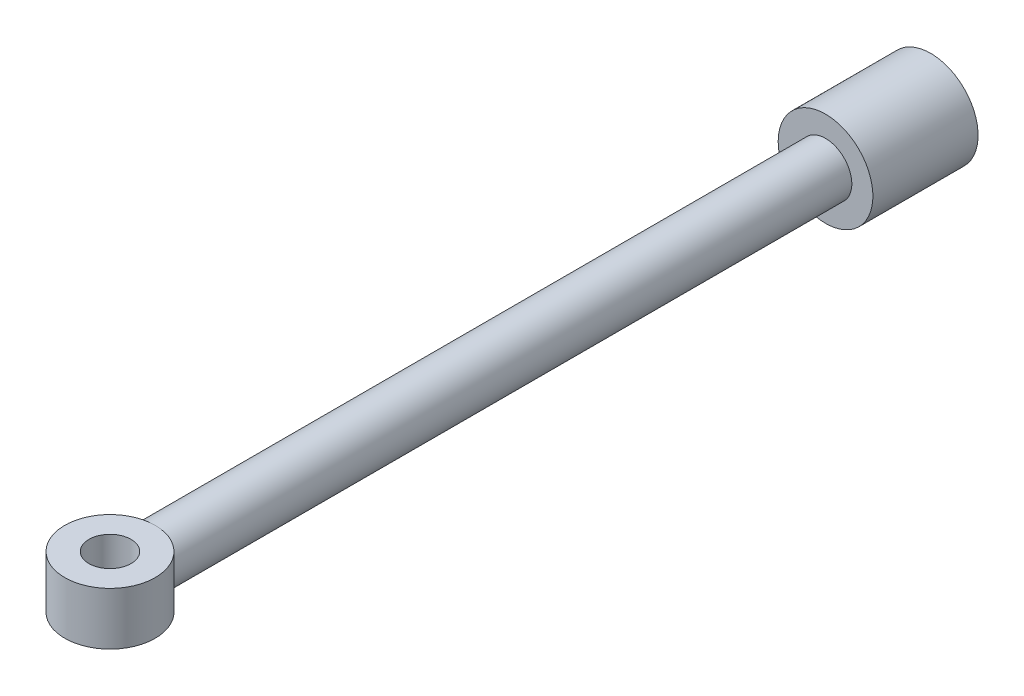
ISO-10303-21;
HEADER;
FILE_DESCRIPTION(('STEP AP214'),'2;1');
FILE_NAME('part.step','',(''),(''),'','','');
FILE_SCHEMA(('AUTOMOTIVE_DESIGN { 1 0 10303 214 1 1 1 1 }'));
ENDSEC;
DATA;
#1=APPLICATION_CONTEXT('core data for automotive mechanical design processes');
#2=APPLICATION_PROTOCOL_DEFINITION('international standard','automotive_design',2000,#1);
#3=PRODUCT_CONTEXT('',#1,'mechanical');
#4=PRODUCT('Part','Part','',(#3));
#5=PRODUCT_RELATED_PRODUCT_CATEGORY('part','',(#4));
#6=PRODUCT_DEFINITION_FORMATION('','',#4);
#7=PRODUCT_DEFINITION_CONTEXT('part definition',#1,'design');
#8=PRODUCT_DEFINITION('design','',#6,#7);
#9=PRODUCT_DEFINITION_SHAPE('','',#8);
#10=(LENGTH_UNIT() NAMED_UNIT(*) SI_UNIT(.MILLI.,.METRE.));
#11=(NAMED_UNIT(*) PLANE_ANGLE_UNIT() SI_UNIT($,.RADIAN.));
#12=(NAMED_UNIT(*) SI_UNIT($,.STERADIAN.) SOLID_ANGLE_UNIT());
#13=UNCERTAINTY_MEASURE_WITH_UNIT(LENGTH_MEASURE(1.E-05),#10,'distance_accuracy_value','');
#14=(GEOMETRIC_REPRESENTATION_CONTEXT(3) GLOBAL_UNCERTAINTY_ASSIGNED_CONTEXT((#13)) GLOBAL_UNIT_ASSIGNED_CONTEXT((#10,
#11,#12)) REPRESENTATION_CONTEXT('',''));
#15=CARTESIAN_POINT('',(0.,0.,0.));
#16=DIRECTION('',(0.,0.,1.));
#17=DIRECTION('',(1.,0.,0.));
#18=AXIS2_PLACEMENT_3D('',#15,#16,#17);
#19=CARTESIAN_POINT('',(0.,0.,75.));
#20=DIRECTION('',(0.,0.,-1.));
#21=DIRECTION('',(-1.,0.,0.));
#22=AXIS2_PLACEMENT_3D('',#19,#20,#21);
#23=CYLINDRICAL_SURFACE('',#22,25.);
#24=CARTESIAN_POINT('',(0.,0.,175.));
#25=DIRECTION('',(0.,0.,-1.));
#26=DIRECTION('',(-1.,0.,0.));
#27=AXIS2_PLACEMENT_3D('',#24,#25,#26);
#28=CIRCLE('',#27,25.);
#29=CARTESIAN_POINT('',(-25.,0.,175.));
#30=VERTEX_POINT('',#29);
#31=EDGE_CURVE('E65',#30,#30,#28,.T.);
#32=ORIENTED_EDGE('',*,*,#31,.F.);
#33=EDGE_LOOP('',(#32));
#34=FACE_BOUND('',#33,.T.);
#35=CARTESIAN_POINT('',(0.,25.,812.));
#36=CARTESIAN_POINT('',(-0.323073219483373,25.0000073405273,811.999991917627));
#37=CARTESIAN_POINT('',(-0.646141502338046,24.9937375418738,812.003640863775));
#38=CARTESIAN_POINT('',(-1.29162001946689,24.9686991510117,812.018192836309));
#39=CARTESIAN_POINT('',(-1.61403027385897,24.9499309468376,812.029095637485));
#40=CARTESIAN_POINT('',(-2.25741128983295,24.8999631376806,812.058088437141));
#41=CARTESIAN_POINT('',(-2.57838266443131,24.8687694638436,812.076175006525));
#42=CARTESIAN_POINT('',(-3.21838786165717,24.7940682668799,812.119411054166));
#43=CARTESIAN_POINT('',(-3.5374216777822,24.7505607024509,812.144560556112));
#44=CARTESIAN_POINT('',(-4.48730779691503,24.6022973988042,812.230076116417));
#45=CARTESIAN_POINT('',(-5.1145512854202,24.4795184962338,812.300674658644));
#46=CARTESIAN_POINT('',(-6.35450877170136,24.1873147832337,812.467519884291));
#47=CARTESIAN_POINT('',(-6.96722161414905,24.0178862771203,812.563768599754));
#48=CARTESIAN_POINT('',(-8.17325775073618,23.6346675452906,812.77947806231));
#49=CARTESIAN_POINT('',(-8.76661117389672,23.4209504719296,812.898900512425));
#50=CARTESIAN_POINT('',(-9.93159556183184,22.9512078223228,813.15839840602));
#51=CARTESIAN_POINT('',(-10.5032266492576,22.6951824850065,813.298473732864));
#52=CARTESIAN_POINT('',(-11.6225774564603,22.1428459411344,813.596479530529));
#53=CARTESIAN_POINT('',(-12.1702716259285,21.8464930125044,813.75442846412));
#54=CARTESIAN_POINT('',(-13.2388292536092,21.2159917334919,814.084889987469));
#55=CARTESIAN_POINT('',(-13.759691534578,20.8818417268222,814.257403215356));
#56=CARTESIAN_POINT('',(-14.8097037618993,20.152189070235,814.626684737254));
#57=CARTESIAN_POINT('',(-15.3366791442554,19.7539876429895,814.824304274079));
#58=CARTESIAN_POINT('',(-16.355570131578,18.9190176170641,815.228204609291));
#59=CARTESIAN_POINT('',(-16.8474842861503,18.4822474245634,815.434485765429));
#60=CARTESIAN_POINT('',(-17.7949550173283,17.5718979612226,815.851465937347));
#61=CARTESIAN_POINT('',(-18.2504761742981,17.0982836954337,816.062169010958));
#62=CARTESIAN_POINT('',(-19.1229526377762,16.1165747091056,816.483155088647));
#63=CARTESIAN_POINT('',(-19.5399059530893,15.6084782106497,816.69343807049));
#64=CARTESIAN_POINT('',(-20.3786164952388,14.4999450687305,817.132326474249));
#65=CARTESIAN_POINT('',(-20.7955295482988,13.8955778996803,817.36029664006));
#66=CARTESIAN_POINT('',(-21.576620180258,12.6487421591043,817.802540616851));
#67=CARTESIAN_POINT('',(-21.9407898478575,12.0062678919936,818.016812370435));
#68=CARTESIAN_POINT('',(-22.6127328991702,10.6869824653493,818.42379930329));
#69=CARTESIAN_POINT('',(-22.9205777197122,10.0102162099253,818.616541665673));
#70=CARTESIAN_POINT('',(-23.4767842757009,8.62536266913667,818.972928714695));
#71=CARTESIAN_POINT('',(-23.7251664515645,7.91728624615677,819.136583395293));
#72=CARTESIAN_POINT('',(-24.1092135452026,6.63955323298844,819.394012848847));
#73=CARTESIAN_POINT('',(-24.2576658880458,6.07520751593119,819.495211205358));
#74=CARTESIAN_POINT('',(-24.5153025535408,4.93376834216407,819.672610024112));
#75=CARTESIAN_POINT('',(-24.624492741889,4.3566768033426,819.74881422029));
#76=CARTESIAN_POINT('',(-24.8021169016052,3.19383705209388,819.873559654141));
#77=CARTESIAN_POINT('',(-24.8705893792807,2.60809755702325,819.922127025787));
#78=CARTESIAN_POINT('',(-24.9659584223035,1.43151915987221,819.989938896084));
#79=CARTESIAN_POINT('',(-24.9928541916901,0.840680160382653,820.009182833357));
#80=CARTESIAN_POINT('',(-25.0046644537354,-0.342553531027865,820.017621374834));
#81=CARTESIAN_POINT('',(-24.9895136493183,-0.934949213713527,820.006769240754));
#82=CARTESIAN_POINT('',(-24.9173247406087,-2.11586738550418,819.95533043359));
#83=CARTESIAN_POINT('',(-24.8602864559335,-2.7043898579187,819.914743632457));
#84=CARTESIAN_POINT('',(-24.705118667433,-3.87365051320268,819.805311753865));
#85=CARTESIAN_POINT('',(-24.6069650173244,-4.45438391452943,819.736450071568));
#86=CARTESIAN_POINT('',(-24.3708826196281,-5.6039678815932,819.572882645657));
#87=CARTESIAN_POINT('',(-24.2329529294204,-6.17281816537927,819.478176289573));
#88=CARTESIAN_POINT('',(-23.9200588841416,-7.29148537237563,819.266736481832));
#89=CARTESIAN_POINT('',(-23.7453650735208,-7.84140893784098,819.150164583484));
#90=CARTESIAN_POINT('',(-23.3599923313202,-8.92418988387642,818.897870163549));
#91=CARTESIAN_POINT('',(-23.149298868061,-9.4570402691045,818.762139912332));
#92=CARTESIAN_POINT('',(-22.6936550015159,-10.5035103373492,818.47507028058));
#93=CARTESIAN_POINT('',(-22.4487039520211,-11.017129657374,818.323730605615));
#94=CARTESIAN_POINT('',(-21.9261058615668,-12.0236223707595,818.008934340018));
#95=CARTESIAN_POINT('',(-21.6484550342576,-12.5164933526563,817.845476347004));
#96=CARTESIAN_POINT('',(-21.0133747545135,-13.5598748043819,817.482096451958));
#97=CARTESIAN_POINT('',(-20.6503450688302,-14.1064404244398,817.280614309169));
#98=CARTESIAN_POINT('',(-19.8838315939996,-15.1677892371372,816.870980814586));
#99=CARTESIAN_POINT('',(-19.4803443889607,-15.6825697401703,816.662828900663));
#100=CARTESIAN_POINT('',(-18.6343106730208,-16.6790289504848,816.244544541118));
#101=CARTESIAN_POINT('',(-18.1917279308608,-17.1606762010386,816.034410423032));
#102=CARTESIAN_POINT('',(-17.2695024774643,-18.0884534042604,815.617002238479));
#103=CARTESIAN_POINT('',(-16.7898579259701,-18.5345815910375,815.409728314636));
#104=CARTESIAN_POINT('',(-15.733857262801,-19.4419172482329,814.977381346595));
#105=CARTESIAN_POINT('',(-15.1528672405291,-19.8982075430565,814.753262732965));
#106=CARTESIAN_POINT('',(-13.9488810741164,-20.7599803780785,814.320300022891));
#107=CARTESIAN_POINT('',(-13.3258810956641,-21.1654582708725,814.111457324338));
#108=CARTESIAN_POINT('',(-12.0423003328998,-21.9211449030045,813.715217486015));
#109=CARTESIAN_POINT('',(-11.3817895732271,-22.2714523003018,813.527782233517));
#110=CARTESIAN_POINT('',(-10.0262438133686,-22.9136791762596,813.179384301884));
#111=CARTESIAN_POINT('',(-9.33121177846104,-23.2056036590542,813.018419354127));
#112=CARTESIAN_POINT('',(-7.94372462011019,-23.7153694620421,812.734458317691));
#113=CARTESIAN_POINT('',(-7.2525598476481,-23.935952478089,812.610080026114));
#114=CARTESIAN_POINT('',(-5.84882965497463,-24.3170639383683,812.393722450943));
#115=CARTESIAN_POINT('',(-5.13626793238095,-24.4776026950914,812.301737603995));
#116=CARTESIAN_POINT('',(-4.05369539716519,-24.671920503785,812.189943321606));
#117=CARTESIAN_POINT('',(-3.68905733973753,-24.7290793691959,812.156963391952));
#118=CARTESIAN_POINT('',(-2.95687043208221,-24.8272688018788,812.100213911025));
#119=CARTESIAN_POINT('',(-2.58932160100161,-24.8682994751525,812.076444299219));
#120=CARTESIAN_POINT('',(-1.85197952858847,-24.9340583440999,812.0383134043));
#121=CARTESIAN_POINT('',(-1.48218467381487,-24.9587729425175,812.023959968367));
#122=CARTESIAN_POINT('',(-0.741596033911642,-24.9917505720782,812.004796005515));
#123=CARTESIAN_POINT('',(-0.370802195670496,-25.000012710516,811.999985996419));
#124=CARTESIAN_POINT('',(0.,-25.,812.));
#125=B_SPLINE_CURVE_WITH_KNOTS('',3,(#35,#36,#37,#38,#39,#40,#41,#42,#43,#44,#45,#46,#47,#48,
#49,#50,#51,#52,#53,#54,#55,#56,#57,#58,#59,#60,#61,#62,#63,#64,#65,#66,#67,#68,#69,#70,#71,#72,
#73,#74,#75,#76,#77,#78,#79,#80,#81,#82,#83,#84,#85,#86,#87,#88,#89,#90,#91,#92,#93,#94,#95,#96,
#97,#98,#99,#100,#101,#102,#103,#104,#105,#106,#107,#108,#109,#110,#111,#112,#113,#114,#115,
#116,#117,#118,#119,#120,#121,#122,#123,#124),.UNSPECIFIED.,.F.,.F.,(4,2,2,2,2,2,2,2,2,2,2,2,2,
2,2,2,2,2,2,2,2,2,2,2,2,2,2,2,2,2,2,2,2,2,2,2,2,2,2,2,2,2,2,2,4),(0.,0.969129286855344,
1.9382284868321,2.90686565243429,3.87550606700364,5.80196075601257,7.72856810690569,
9.65201824772579,11.5754575265229,13.500902102308,15.4264310847567,17.4926341354823,
19.5589226102521,21.6271982123862,23.6955805367091,25.9991410406336,28.3030467124911,
30.6040097719282,32.9041807307745,34.6791412126934,36.4538364083727,38.2268506135154,
39.9998987615087,41.775701940575,43.551512766942,45.3283679591154,47.1052652629894,
48.8695171920972,50.6344829718385,52.3994820490406,54.1646856990844,56.2217681123882,
58.2790243548663,60.338207544928,62.397493046943,64.7105585581636,67.0238354728348,
69.3329275414591,71.6418216075804,73.8468588699269,76.0515172471042,77.1628077730092,
78.2740909949048,79.3862991569077,80.4985676653297),.UNSPECIFIED.);
#126=CARTESIAN_POINT('',(0.,25.,812.));
#127=VERTEX_POINT('',#126);
#128=CARTESIAN_POINT('',(0.,-25.,812.));
#129=VERTEX_POINT('',#128);
#130=EDGE_CURVE('E54',#127,#129,#125,.T.);
#131=ORIENTED_EDGE('',*,*,#130,.F.);
#132=CARTESIAN_POINT('',(0.,-25.,812.));
#133=CARTESIAN_POINT('',(0.323073219483558,-25.0000073405273,811.999991917627));
#134=CARTESIAN_POINT('',(0.64614150233823,-24.9937375418738,812.003640863775));
#135=CARTESIAN_POINT('',(1.29162001946707,-24.9686991510117,812.018192836309));
#136=CARTESIAN_POINT('',(1.61403027385916,-24.9499309468376,812.029095637485));
#137=CARTESIAN_POINT('',(2.25741128983314,-24.8999631376806,812.058088437141));
#138=CARTESIAN_POINT('',(2.5783826644315,-24.8687694638436,812.076175006525));
#139=CARTESIAN_POINT('',(3.21838786165736,-24.7940682668799,812.119411054166));
#140=CARTESIAN_POINT('',(3.53742167778238,-24.7505607024509,812.144560556112));
#141=CARTESIAN_POINT('',(4.48730779691522,-24.6022973988042,812.230076116417));
#142=CARTESIAN_POINT('',(5.11455128542039,-24.4795184962339,812.300674658644));
#143=CARTESIAN_POINT('',(6.35450877170155,-24.1873147832337,812.467519884291));
#144=CARTESIAN_POINT('',(6.96722161414924,-24.0178862771203,812.563768599754));
#145=CARTESIAN_POINT('',(8.17325775073636,-23.6346675452906,812.77947806231));
#146=CARTESIAN_POINT('',(8.76661117389689,-23.4209504719296,812.898900512425));
#147=CARTESIAN_POINT('',(9.931595561832,-22.9512078223228,813.15839840602));
#148=CARTESIAN_POINT('',(10.5032266492578,-22.6951824850066,813.298473732864));
#149=CARTESIAN_POINT('',(11.6225774564605,-22.1428459411344,813.596479530529));
#150=CARTESIAN_POINT('',(12.1702716259287,-21.8464930125044,813.75442846412));
#151=CARTESIAN_POINT('',(13.2388292536094,-21.2159917334919,814.084889987469));
#152=CARTESIAN_POINT('',(13.7596915345782,-20.8818417268222,814.257403215356));
#153=CARTESIAN_POINT('',(14.8097037618995,-20.152189070235,814.626684737254));
#154=CARTESIAN_POINT('',(15.3366791442556,-19.7539876429895,814.824304274079));
#155=CARTESIAN_POINT('',(16.3555701315782,-18.9190176170641,815.228204609291));
#156=CARTESIAN_POINT('',(16.8474842861505,-18.4822474245634,815.434485765429));
#157=CARTESIAN_POINT('',(17.7949550173285,-17.5718979612226,815.851465937347));
#158=CARTESIAN_POINT('',(18.2504761742983,-17.0982836954337,816.062169010958));
#159=CARTESIAN_POINT('',(19.1229526377764,-16.1165747091056,816.483155088647));
#160=CARTESIAN_POINT('',(19.5399059530895,-15.6084782106497,816.69343807049));
#161=CARTESIAN_POINT('',(20.378616495239,-14.4999450687305,817.132326474249));
#162=CARTESIAN_POINT('',(20.795529548299,-13.8955778996803,817.36029664006));
#163=CARTESIAN_POINT('',(21.5766201802581,-12.6487421591043,817.802540616851));
#164=CARTESIAN_POINT('',(21.9407898478576,-12.0062678919936,818.016812370435));
#165=CARTESIAN_POINT('',(22.6127328991704,-10.6869824653493,818.42379930329));
#166=CARTESIAN_POINT('',(22.9205777197124,-10.0102162099253,818.616541665673));
#167=CARTESIAN_POINT('',(23.4767842757011,-8.62536266913666,818.972928714695));
#168=CARTESIAN_POINT('',(23.7251664515647,-7.91728624615676,819.136583395293));
#169=CARTESIAN_POINT('',(24.1092135452027,-6.63955323298843,819.394012848847));
#170=CARTESIAN_POINT('',(24.257665888046,-6.07520751593117,819.495211205358));
#171=CARTESIAN_POINT('',(24.515302553541,-4.93376834216405,819.672610024112));
#172=CARTESIAN_POINT('',(24.6244927418892,-4.35667680334257,819.74881422029));
#173=CARTESIAN_POINT('',(24.8021169016054,-3.19383705209385,819.873559654141));
#174=CARTESIAN_POINT('',(24.8705893792809,-2.60809755702321,819.922127025787));
#175=CARTESIAN_POINT('',(24.9659584223036,-1.43151915987217,819.989938896084));
#176=CARTESIAN_POINT('',(24.9928541916903,-0.840680160382614,820.009182833357));
#177=CARTESIAN_POINT('',(25.0046644537356,0.342553531027907,820.017621374834));
#178=CARTESIAN_POINT('',(24.9895136493185,0.93494921371357,820.006769240754));
#179=CARTESIAN_POINT('',(24.9173247406089,2.11586738550422,819.95533043359));
#180=CARTESIAN_POINT('',(24.8602864559336,2.70438985791874,819.914743632457));
#181=CARTESIAN_POINT('',(24.7051186674332,3.87365051320273,819.805311753865));
#182=CARTESIAN_POINT('',(24.6069650173246,4.45438391452948,819.736450071568));
#183=CARTESIAN_POINT('',(24.3708826196282,5.60396788159325,819.572882645657));
#184=CARTESIAN_POINT('',(24.2329529294206,6.17281816537932,819.478176289573));
#185=CARTESIAN_POINT('',(23.9200588841418,7.29148537237568,819.266736481832));
#186=CARTESIAN_POINT('',(23.745365073521,7.84140893784102,819.150164583484));
#187=CARTESIAN_POINT('',(23.3599923313203,8.92418988387646,818.897870163549));
#188=CARTESIAN_POINT('',(23.1492988680612,9.45704026910456,818.762139912332));
#189=CARTESIAN_POINT('',(22.6936550015161,10.5035103373493,818.47507028058));
#190=CARTESIAN_POINT('',(22.4487039520212,11.017129657374,818.323730605615));
#191=CARTESIAN_POINT('',(21.9261058615669,12.0236223707596,818.008934340018));
#192=CARTESIAN_POINT('',(21.6484550342578,12.5164933526564,817.845476347004));
#193=CARTESIAN_POINT('',(21.0133747545137,13.5598748043819,817.482096451958));
#194=CARTESIAN_POINT('',(20.6503450688303,14.1064404244399,817.280614309169));
#195=CARTESIAN_POINT('',(19.8838315939997,15.1677892371372,816.870980814586));
#196=CARTESIAN_POINT('',(19.4803443889608,15.6825697401703,816.662828900663));
#197=CARTESIAN_POINT('',(18.6343106730209,16.6790289504848,816.244544541118));
#198=CARTESIAN_POINT('',(18.1917279308609,17.1606762010386,816.034410423032));
#199=CARTESIAN_POINT('',(17.2695024774645,18.0884534042604,815.617002238479));
#200=CARTESIAN_POINT('',(16.7898579259703,18.5345815910376,815.409728314636));
#201=CARTESIAN_POINT('',(15.7338572628012,19.4419172482329,814.977381346595));
#202=CARTESIAN_POINT('',(15.1528672405293,19.8982075430566,814.753262732966));
#203=CARTESIAN_POINT('',(13.9488810741166,20.7599803780785,814.320300022891));
#204=CARTESIAN_POINT('',(13.3258810956643,21.1654582708726,814.111457324338));
#205=CARTESIAN_POINT('',(12.0423003328999,21.9211449030045,813.715217486015));
#206=CARTESIAN_POINT('',(11.3817895732272,22.2714523003018,813.527782233517));
#207=CARTESIAN_POINT('',(10.0262438133687,22.9136791762597,813.179384301884));
#208=CARTESIAN_POINT('',(9.33121177846115,23.2056036590542,813.018419354127));
#209=CARTESIAN_POINT('',(7.94372462011032,23.7153694620421,812.734458317691));
#210=CARTESIAN_POINT('',(7.25255984764822,23.935952478089,812.610080026114));
#211=CARTESIAN_POINT('',(5.84882965497477,24.3170639383683,812.393722450943));
#212=CARTESIAN_POINT('',(5.13626793238109,24.4776026950914,812.301737603995));
#213=CARTESIAN_POINT('',(4.05369539716533,24.671920503785,812.189943321606));
#214=CARTESIAN_POINT('',(3.68905733973768,24.7290793691959,812.156963391952));
#215=CARTESIAN_POINT('',(2.95687043208236,24.8272688018788,812.100213911025));
#216=CARTESIAN_POINT('',(2.58932160100177,24.8682994751525,812.076444299219));
#217=CARTESIAN_POINT('',(1.85197952858864,24.9340583440999,812.0383134043));
#218=CARTESIAN_POINT('',(1.48218467381504,24.9587729425175,812.023959968367));
#219=CARTESIAN_POINT('',(0.741596033911814,24.9917505720782,812.004796005515));
#220=CARTESIAN_POINT('',(0.370802195670674,25.000012710516,811.999985996419));
#221=CARTESIAN_POINT('',(1.02130452942603E-13,25.,812.));
#222=B_SPLINE_CURVE_WITH_KNOTS('',3,(#132,#133,#134,#135,#136,#137,#138,#139,#140,#141,#142,
#143,#144,#145,#146,#147,#148,#149,#150,#151,#152,#153,#154,#155,#156,#157,#158,#159,#160,#161,
#162,#163,#164,#165,#166,#167,#168,#169,#170,#171,#172,#173,#174,#175,#176,#177,#178,#179,#180,
#181,#182,#183,#184,#185,#186,#187,#188,#189,#190,#191,#192,#193,#194,#195,#196,#197,#198,#199,
#200,#201,#202,#203,#204,#205,#206,#207,#208,#209,#210,#211,#212,#213,#214,#215,#216,#217,#218,
#219,#220,#221),.UNSPECIFIED.,.F.,.F.,(4,2,2,2,2,2,2,2,2,2,2,2,2,2,2,2,2,2,2,2,2,2,2,2,2,2,2,2,
2,2,2,2,2,2,2,2,2,2,2,2,2,2,2,2,4),(0.,0.969129286855342,1.93822848683209,2.90686565243429,
3.87550606700364,5.80196075601257,7.7285681069057,9.65201824772576,11.5754575265229,
13.500902102308,15.4264310847567,17.4926341354823,19.5589226102521,21.6271982123862,
23.6955805367091,25.9991410406336,28.3030467124911,30.6040097719282,32.9041807307745,
34.6791412126934,36.4538364083727,38.2268506135154,39.9998987615087,41.775701940575,
43.5515127669421,45.3283679591154,47.1052652629895,48.8695171920973,50.6344829718386,
52.3994820490406,54.1646856990845,56.2217681123882,58.2790243548664,60.338207544928,
62.397493046943,64.7105585581636,67.0238354728349,69.3329275414592,71.6418216075805,
73.8468588699269,76.0515172471042,77.1628077730092,78.2740909949048,79.3862991569076,
80.4985676653297),.UNSPECIFIED.);
#223=EDGE_CURVE('E57',#129,#127,#222,.T.);
#224=ORIENTED_EDGE('',*,*,#223,.F.);
#225=EDGE_LOOP('',(#131,#224));
#226=FACE_BOUND('',#225,.T.);
#227=ADVANCED_FACE('F39',(#34,#226),#23,.T.);
#228=CARTESIAN_POINT('',(0.,0.,75.));
#229=DIRECTION('',(0.,0.,1.));
#230=DIRECTION('',(1.,0.,0.));
#231=AXIS2_PLACEMENT_3D('',#228,#229,#230);
#232=PLANE('',#231);
#233=CARTESIAN_POINT('',(0.,0.,75.));
#234=DIRECTION('',(0.,0.,-1.));
#235=DIRECTION('',(-1.,0.,0.));
#236=AXIS2_PLACEMENT_3D('',#233,#234,#235);
#237=CIRCLE('',#236,45.);
#238=CARTESIAN_POINT('',(-45.,0.,75.));
#239=VERTEX_POINT('',#238);
#240=EDGE_CURVE('E11',#239,#239,#237,.T.);
#241=ORIENTED_EDGE('',*,*,#240,.T.);
#242=EDGE_LOOP('',(#241));
#243=FACE_BOUND('',#242,.T.);
#244=ADVANCED_FACE('F41',(#243),#232,.F.);
#245=CARTESIAN_POINT('',(0.,0.,75.));
#246=DIRECTION('',(0.,0.,-1.));
#247=DIRECTION('',(-1.,0.,0.));
#248=AXIS2_PLACEMENT_3D('',#245,#246,#247);
#249=CYLINDRICAL_SURFACE('',#248,45.);
#250=ORIENTED_EDGE('',*,*,#240,.F.);
#251=EDGE_LOOP('',(#250));
#252=FACE_BOUND('',#251,.T.);
#253=CARTESIAN_POINT('',(0.,0.,175.));
#254=DIRECTION('',(0.,0.,-1.));
#255=DIRECTION('',(-1.,0.,0.));
#256=AXIS2_PLACEMENT_3D('',#253,#254,#255);
#257=CIRCLE('',#256,45.);
#258=CARTESIAN_POINT('',(-45.,0.,175.));
#259=VERTEX_POINT('',#258);
#260=EDGE_CURVE('E47',#259,#259,#257,.T.);
#261=ORIENTED_EDGE('',*,*,#260,.T.);
#262=EDGE_LOOP('',(#261));
#263=FACE_BOUND('',#262,.T.);
#264=ADVANCED_FACE('F112',(#252,#263),#249,.T.);
#265=CARTESIAN_POINT('',(45.,0.,175.));
#266=DIRECTION('',(0.,0.,-1.));
#267=DIRECTION('',(-1.,0.,0.));
#268=AXIS2_PLACEMENT_3D('',#265,#266,#267);
#269=PLANE('',#268);
#270=ORIENTED_EDGE('',*,*,#260,.F.);
#271=EDGE_LOOP('',(#270));
#272=FACE_BOUND('',#271,.T.);
#273=ORIENTED_EDGE('',*,*,#31,.T.);
#274=EDGE_LOOP('',(#273));
#275=FACE_BOUND('',#274,.T.);
#276=ADVANCED_FACE('F92',(#272,#275),#269,.F.);
#277=CARTESIAN_POINT('',(0.,25.,855.));
#278=DIRECTION('',(0.,-1.,0.));
#279=DIRECTION('',(0.,0.,-1.));
#280=AXIS2_PLACEMENT_3D('',#277,#278,#279);
#281=CYLINDRICAL_SURFACE('',#280,43.);
#282=CARTESIAN_POINT('',(0.,25.,855.));
#283=DIRECTION('',(0.,1.,0.));
#284=DIRECTION('',(0.,0.,1.));
#285=AXIS2_PLACEMENT_3D('',#282,#283,#284);
#286=CIRCLE('',#285,43.);
#287=EDGE_CURVE('E60',#127,#127,#286,.T.);
#288=ORIENTED_EDGE('',*,*,#287,.F.);
#289=ORIENTED_EDGE('',*,*,#130,.T.);
#290=CARTESIAN_POINT('',(0.,-25.,855.));
#291=DIRECTION('',(0.,1.,0.));
#292=DIRECTION('',(0.,0.,1.));
#293=AXIS2_PLACEMENT_3D('',#290,#291,#292);
#294=CIRCLE('',#293,43.);
#295=EDGE_CURVE('E62',#129,#129,#294,.T.);
#296=ORIENTED_EDGE('',*,*,#295,.T.);
#297=ORIENTED_EDGE('',*,*,#223,.T.);
#298=EDGE_LOOP('',(#288,#289,#296,#297));
#299=FACE_BOUND('',#298,.T.);
#300=ADVANCED_FACE('F58',(#299),#281,.T.);
#301=CARTESIAN_POINT('',(0.,25.,855.));
#302=DIRECTION('',(0.,1.,0.));
#303=DIRECTION('',(0.,0.,1.));
#304=AXIS2_PLACEMENT_3D('',#301,#302,#303);
#305=PLANE('',#304);
#306=ORIENTED_EDGE('',*,*,#287,.T.);
#307=EDGE_LOOP('',(#306));
#308=FACE_BOUND('',#307,.T.);
#309=CARTESIAN_POINT('',(0.,25.,855.));
#310=DIRECTION('',(0.,1.,0.));
#311=DIRECTION('',(0.,0.,1.));
#312=AXIS2_PLACEMENT_3D('',#309,#310,#311);
#313=CIRCLE('',#312,20.);
#314=CARTESIAN_POINT('',(0.,25.,875.));
#315=VERTEX_POINT('',#314);
#316=EDGE_CURVE('E71',#315,#315,#313,.T.);
#317=ORIENTED_EDGE('',*,*,#316,.F.);
#318=EDGE_LOOP('',(#317));
#319=FACE_BOUND('',#318,.T.);
#320=ADVANCED_FACE('F68',(#308,#319),#305,.T.);
#321=CARTESIAN_POINT('',(0.,-25.,855.));
#322=DIRECTION('',(0.,1.,0.));
#323=DIRECTION('',(0.,0.,1.));
#324=AXIS2_PLACEMENT_3D('',#321,#322,#323);
#325=PLANE('',#324);
#326=ORIENTED_EDGE('',*,*,#295,.F.);
#327=EDGE_LOOP('',(#326));
#328=FACE_BOUND('',#327,.T.);
#329=CARTESIAN_POINT('',(0.,-25.,855.));
#330=DIRECTION('',(0.,1.,0.));
#331=DIRECTION('',(0.,0.,1.));
#332=AXIS2_PLACEMENT_3D('',#329,#330,#331);
#333=CIRCLE('',#332,20.);
#334=CARTESIAN_POINT('',(0.,-25.,875.));
#335=VERTEX_POINT('',#334);
#336=EDGE_CURVE('E74',#335,#335,#333,.T.);
#337=ORIENTED_EDGE('',*,*,#336,.T.);
#338=EDGE_LOOP('',(#337));
#339=FACE_BOUND('',#338,.T.);
#340=ADVANCED_FACE('F93',(#328,#339),#325,.F.);
#341=CARTESIAN_POINT('',(0.,25.,855.));
#342=DIRECTION('',(0.,-1.,0.));
#343=DIRECTION('',(0.,0.,-1.));
#344=AXIS2_PLACEMENT_3D('',#341,#342,#343);
#345=CYLINDRICAL_SURFACE('',#344,20.);
#346=ORIENTED_EDGE('',*,*,#316,.T.);
#347=EDGE_LOOP('',(#346));
#348=FACE_BOUND('',#347,.T.);
#349=ORIENTED_EDGE('',*,*,#336,.F.);
#350=EDGE_LOOP('',(#349));
#351=FACE_BOUND('',#350,.T.);
#352=ADVANCED_FACE('F97',(#348,#351),#345,.F.);
#353=CLOSED_SHELL('',(#227,#244,#264,#276,#300,#320,#340,#352));
#354=MANIFOLD_SOLID_BREP('B2',#353);
#355=ADVANCED_BREP_SHAPE_REPRESENTATION('',(#18,#354),#14);
#356=SHAPE_DEFINITION_REPRESENTATION(#9,#355);
ENDSEC;
END-ISO-10303-21;
